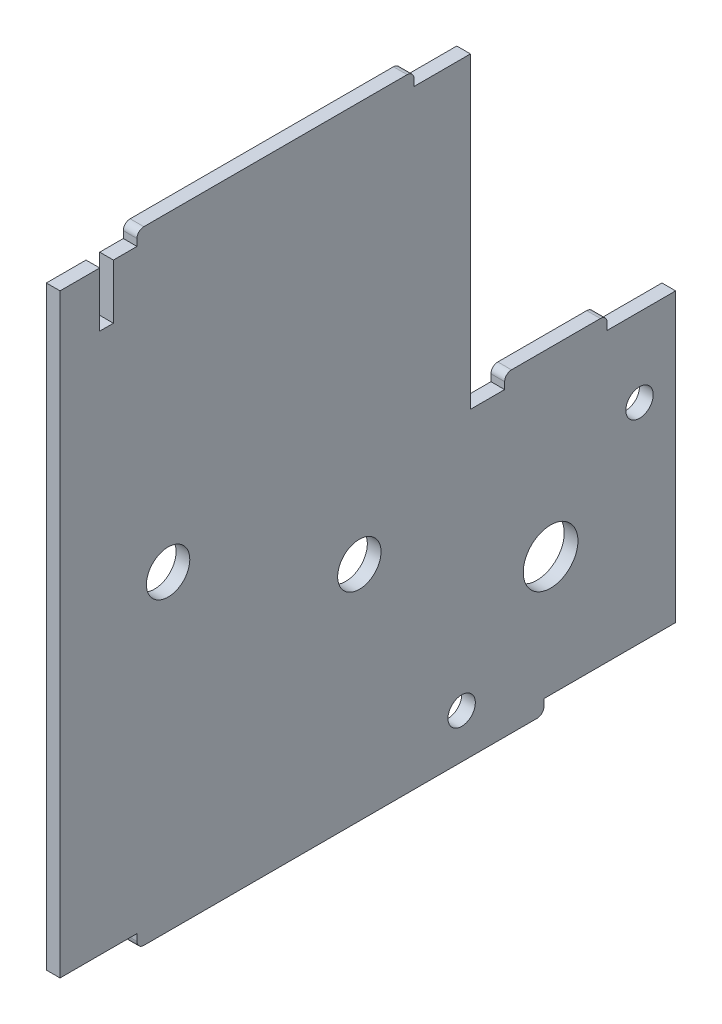
ISO-10303-21;
HEADER;
FILE_DESCRIPTION(('STEP AP214'),'2;1');
FILE_NAME('part.step','',(''),(''),'','','');
FILE_SCHEMA(('AUTOMOTIVE_DESIGN { 1 0 10303 214 1 1 1 1 }'));
ENDSEC;
DATA;
#1=APPLICATION_CONTEXT('core data for automotive mechanical design processes');
#2=APPLICATION_PROTOCOL_DEFINITION('international standard','automotive_design',2000,#1);
#3=PRODUCT_CONTEXT('',#1,'mechanical');
#4=PRODUCT('Part','Part','',(#3));
#5=PRODUCT_RELATED_PRODUCT_CATEGORY('part','',(#4));
#6=PRODUCT_DEFINITION_FORMATION('','',#4);
#7=PRODUCT_DEFINITION_CONTEXT('part definition',#1,'design');
#8=PRODUCT_DEFINITION('design','',#6,#7);
#9=PRODUCT_DEFINITION_SHAPE('','',#8);
#10=(LENGTH_UNIT() NAMED_UNIT(*) SI_UNIT(.MILLI.,.METRE.));
#11=(NAMED_UNIT(*) PLANE_ANGLE_UNIT() SI_UNIT($,.RADIAN.));
#12=(NAMED_UNIT(*) SI_UNIT($,.STERADIAN.) SOLID_ANGLE_UNIT());
#13=UNCERTAINTY_MEASURE_WITH_UNIT(LENGTH_MEASURE(1.E-05),#10,'distance_accuracy_value','');
#14=(GEOMETRIC_REPRESENTATION_CONTEXT(3) GLOBAL_UNCERTAINTY_ASSIGNED_CONTEXT((#13)) GLOBAL_UNIT_ASSIGNED_CONTEXT((#10,
#11,#12)) REPRESENTATION_CONTEXT('',''));
#15=CARTESIAN_POINT('',(0.,0.,0.));
#16=DIRECTION('',(0.,0.,1.));
#17=DIRECTION('',(1.,0.,0.));
#18=AXIS2_PLACEMENT_3D('',#15,#16,#17);
#19=CARTESIAN_POINT('',(2.,3.03009240885106,-30.5193675943872));
#20=DIRECTION('',(-1.,0.,0.));
#21=DIRECTION('',(0.,0.,1.));
#22=AXIS2_PLACEMENT_3D('',#19,#20,#21);
#23=PLANE('',#22);
#24=CARTESIAN_POINT('',(2.,3.53009240885117,19.6806324056115));
#25=DIRECTION('',(1.,0.,0.));
#26=DIRECTION('',(0.,0.,-1.));
#27=AXIS2_PLACEMENT_3D('',#24,#25,#26);
#28=CIRCLE('',#27,3.17);
#29=CARTESIAN_POINT('',(2.,3.53009240885117,16.5106324056115));
#30=VERTEX_POINT('',#29);
#31=EDGE_CURVE('E502',#30,#30,#28,.T.);
#32=ORIENTED_EDGE('',*,*,#31,.F.);
#33=EDGE_LOOP('',(#32));
#34=FACE_BOUND('',#33,.T.);
#35=CARTESIAN_POINT('',(2.,-35.4699075911488,-23.2338469677415));
#36=DIRECTION('',(1.,0.,0.));
#37=DIRECTION('',(0.,0.,-1.));
#38=AXIS2_PLACEMENT_3D('',#35,#36,#37);
#39=CIRCLE('',#38,2.);
#40=CARTESIAN_POINT('',(2.,-35.4699075911488,-25.2338469677415));
#41=VERTEX_POINT('',#40);
#42=EDGE_CURVE('E514',#41,#41,#39,.T.);
#43=ORIENTED_EDGE('',*,*,#42,.F.);
#44=EDGE_LOOP('',(#43));
#45=FACE_BOUND('',#44,.T.);
#46=DIRECTION('',(0.,0.,1.));
#47=VECTOR('',#46,1.);
#48=CARTESIAN_POINT('',(2.,47.0300924088512,-16.2688587230235));
#49=LINE('',#48,#47);
#50=CARTESIAN_POINT('',(2.,47.0300924088512,-24.5193675943872));
#51=VERTEX_POINT('',#50);
#52=CARTESIAN_POINT('',(2.,47.0300924088512,-16.2688587230235));
#53=VERTEX_POINT('',#52);
#54=EDGE_CURVE('E303',#51,#53,#49,.T.);
#55=ORIENTED_EDGE('',*,*,#54,.T.);
#56=DIRECTION('',(0.,1.,0.));
#57=VECTOR('',#56,1.);
#58=CARTESIAN_POINT('',(2.,47.0300924088512,-16.2688587230235));
#59=LINE('',#58,#57);
#60=CARTESIAN_POINT('',(2.,48.0300924088512,-16.2688587230235));
#61=VERTEX_POINT('',#60);
#62=EDGE_CURVE('E151',#53,#61,#59,.T.);
#63=ORIENTED_EDGE('',*,*,#62,.T.);
#64=CARTESIAN_POINT('',(2.,48.0300924088512,-15.2688587230235));
#65=DIRECTION('',(1.,0.,0.));
#66=DIRECTION('',(0.,0.,-1.));
#67=AXIS2_PLACEMENT_3D('',#64,#65,#66);
#68=CIRCLE('',#67,1.);
#69=CARTESIAN_POINT('',(2.,49.0300924088512,-15.2688587230235));
#70=VERTEX_POINT('',#69);
#71=EDGE_CURVE('E378',#61,#70,#68,.T.);
#72=ORIENTED_EDGE('',*,*,#71,.T.);
#73=DIRECTION('',(0.,0.,1.));
#74=VECTOR('',#73,1.);
#75=CARTESIAN_POINT('',(2.,49.0300924088512,-15.2688587230235));
#76=LINE('',#75,#74);
#77=CARTESIAN_POINT('',(2.,49.0300924088512,23.2301235342465));
#78=VERTEX_POINT('',#77);
#79=EDGE_CURVE('E397',#70,#78,#76,.T.);
#80=ORIENTED_EDGE('',*,*,#79,.T.);
#81=CARTESIAN_POINT('',(2.,48.0300924088512,23.2301235342465));
#82=DIRECTION('',(1.,0.,0.));
#83=DIRECTION('',(0.,0.,1.));
#84=AXIS2_PLACEMENT_3D('',#81,#82,#83);
#85=CIRCLE('',#84,1.);
#86=CARTESIAN_POINT('',(2.,48.0300924088512,24.2301235342465));
#87=VERTEX_POINT('',#86);
#88=EDGE_CURVE('E394',#78,#87,#85,.T.);
#89=ORIENTED_EDGE('',*,*,#88,.T.);
#90=DIRECTION('',(0.,-1.,0.));
#91=VECTOR('',#90,1.);
#92=CARTESIAN_POINT('',(2.,47.0300924088512,24.2301235342465));
#93=LINE('',#92,#91);
#94=CARTESIAN_POINT('',(2.,47.0300924088512,24.2301235342465));
#95=VERTEX_POINT('',#94);
#96=EDGE_CURVE('E396',#87,#95,#93,.T.);
#97=ORIENTED_EDGE('',*,*,#96,.T.);
#98=DIRECTION('',(0.,0.,1.));
#99=VECTOR('',#98,1.);
#100=CARTESIAN_POINT('',(2.,47.0300924088512,27.6806324056115));
#101=LINE('',#100,#99);
#102=CARTESIAN_POINT('',(2.,47.0300924088512,27.6806324056115));
#103=VERTEX_POINT('',#102);
#104=EDGE_CURVE('E399',#95,#103,#101,.T.);
#105=ORIENTED_EDGE('',*,*,#104,.T.);
#106=DIRECTION('',(0.,-1.,0.));
#107=VECTOR('',#106,1.);
#108=CARTESIAN_POINT('',(2.,39.0300924088512,27.6806324056115));
#109=LINE('',#108,#107);
#110=CARTESIAN_POINT('',(2.,39.0300924088512,27.6806324056115));
#111=VERTEX_POINT('',#110);
#112=EDGE_CURVE('E405',#103,#111,#109,.T.);
#113=ORIENTED_EDGE('',*,*,#112,.T.);
#114=DIRECTION('',(0.,0.,1.));
#115=VECTOR('',#114,1.);
#116=CARTESIAN_POINT('',(2.,39.0300924088512,27.6806324056115));
#117=LINE('',#116,#115);
#118=CARTESIAN_POINT('',(2.,39.0300924088512,29.6806324056115));
#119=VERTEX_POINT('',#118);
#120=EDGE_CURVE('E407',#111,#119,#117,.T.);
#121=ORIENTED_EDGE('',*,*,#120,.T.);
#122=DIRECTION('',(0.,1.,0.));
#123=VECTOR('',#122,1.);
#124=CARTESIAN_POINT('',(2.,39.0300924088512,29.6806324056115));
#125=LINE('',#124,#123);
#126=CARTESIAN_POINT('',(2.,47.0300924088512,29.6806324056115));
#127=VERTEX_POINT('',#126);
#128=EDGE_CURVE('E409',#119,#127,#125,.T.);
#129=ORIENTED_EDGE('',*,*,#128,.T.);
#130=DIRECTION('',(0.,0.,1.));
#131=VECTOR('',#130,1.);
#132=CARTESIAN_POINT('',(2.,47.0300924088512,29.6806324056115));
#133=LINE('',#132,#131);
#134=CARTESIAN_POINT('',(2.,47.0300924088512,35.4806324056113));
#135=VERTEX_POINT('',#134);
#136=EDGE_CURVE('E411',#127,#135,#133,.T.);
#137=ORIENTED_EDGE('',*,*,#136,.T.);
#138=DIRECTION('',(0.,-1.,0.));
#139=VECTOR('',#138,1.);
#140=CARTESIAN_POINT('',(2.,-39.9699075911489,35.4806324056113));
#141=LINE('',#140,#139);
#142=CARTESIAN_POINT('',(2.,-39.9699075911489,35.4806324056113));
#143=VERTEX_POINT('',#142);
#144=EDGE_CURVE('E413',#135,#143,#141,.T.);
#145=ORIENTED_EDGE('',*,*,#144,.T.);
#146=DIRECTION('',(0.,0.,-1.));
#147=VECTOR('',#146,1.);
#148=CARTESIAN_POINT('',(2.,-39.9699075911489,35.4806324056113));
#149=LINE('',#148,#147);
#150=CARTESIAN_POINT('',(2.,-39.9699075911489,24.2301235342488));
#151=VERTEX_POINT('',#150);
#152=EDGE_CURVE('E415',#143,#151,#149,.T.);
#153=ORIENTED_EDGE('',*,*,#152,.T.);
#154=DIRECTION('',(0.,-1.,0.));
#155=VECTOR('',#154,1.);
#156=CARTESIAN_POINT('',(2.,-39.9699075911489,24.2301235342488));
#157=LINE('',#156,#155);
#158=CARTESIAN_POINT('',(2.,-40.9699075911488,24.2301235342489));
#159=VERTEX_POINT('',#158);
#160=EDGE_CURVE('E417',#151,#159,#157,.T.);
#161=ORIENTED_EDGE('',*,*,#160,.T.);
#162=CARTESIAN_POINT('',(2.,-40.9699075911488,23.230123534249));
#163=DIRECTION('',(1.,0.,0.));
#164=DIRECTION('',(0.,0.,1.));
#165=AXIS2_PLACEMENT_3D('',#162,#163,#164);
#166=CIRCLE('',#165,0.999999999999914);
#167=CARTESIAN_POINT('',(2.,-41.9699075911489,23.2301235342488));
#168=VERTEX_POINT('',#167);
#169=EDGE_CURVE('E419',#159,#168,#166,.T.);
#170=ORIENTED_EDGE('',*,*,#169,.T.);
#171=DIRECTION('',(0.,0.,-1.));
#172=VECTOR('',#171,1.);
#173=CARTESIAN_POINT('',(2.,-41.9699075911489,23.2301235342488));
#174=LINE('',#173,#172);
#175=CARTESIAN_POINT('',(2.,-41.9699075911488,-34.2688587230223));
#176=VERTEX_POINT('',#175);
#177=EDGE_CURVE('E421',#168,#176,#174,.T.);
#178=ORIENTED_EDGE('',*,*,#177,.T.);
#179=CARTESIAN_POINT('',(2.,-40.9699075911488,-34.2688587230223));
#180=DIRECTION('',(1.,0.,0.));
#181=DIRECTION('',(0.,0.,-1.));
#182=AXIS2_PLACEMENT_3D('',#179,#180,#181);
#183=CIRCLE('',#182,0.999999999999966);
#184=CARTESIAN_POINT('',(2.,-40.9699075911488,-35.2688587230223));
#185=VERTEX_POINT('',#184);
#186=EDGE_CURVE('E423',#176,#185,#183,.T.);
#187=ORIENTED_EDGE('',*,*,#186,.T.);
#188=DIRECTION('',(0.,1.,0.));
#189=VECTOR('',#188,1.);
#190=CARTESIAN_POINT('',(2.,-39.9699075911489,-35.2688587230223));
#191=LINE('',#190,#189);
#192=CARTESIAN_POINT('',(2.,-39.9699075911489,-35.2688587230223));
#193=VERTEX_POINT('',#192);
#194=EDGE_CURVE('E425',#185,#193,#191,.T.);
#195=ORIENTED_EDGE('',*,*,#194,.T.);
#196=DIRECTION('',(0.,0.,-1.));
#197=VECTOR('',#196,1.);
#198=CARTESIAN_POINT('',(2.,-39.9699075911489,-54.5193675943872));
#199=LINE('',#198,#197);
#200=CARTESIAN_POINT('',(2.,-39.9699075911489,-54.5193675943872));
#201=VERTEX_POINT('',#200);
#202=EDGE_CURVE('E427',#193,#201,#199,.T.);
#203=ORIENTED_EDGE('',*,*,#202,.T.);
#204=DIRECTION('',(0.,1.,0.));
#205=VECTOR('',#204,1.);
#206=CARTESIAN_POINT('',(2.,-39.9699075911489,-54.5193675943872));
#207=LINE('',#206,#205);
#208=CARTESIAN_POINT('',(2.,2.03009240885107,-54.5193675943873));
#209=VERTEX_POINT('',#208);
#210=EDGE_CURVE('E429',#201,#209,#207,.T.);
#211=ORIENTED_EDGE('',*,*,#210,.T.);
#212=DIRECTION('',(0.,0.,1.));
#213=VECTOR('',#212,1.);
#214=CARTESIAN_POINT('',(2.,2.03009240885107,-54.5193675943873));
#215=LINE('',#214,#213);
#216=CARTESIAN_POINT('',(2.,2.03009240885108,-44.5193675943872));
#217=VERTEX_POINT('',#216);
#218=EDGE_CURVE('E431',#209,#217,#215,.T.);
#219=ORIENTED_EDGE('',*,*,#218,.T.);
#220=DIRECTION('',(0.,1.,0.));
#221=VECTOR('',#220,1.);
#222=CARTESIAN_POINT('',(2.,2.03009240885108,-44.5193675943872));
#223=LINE('',#222,#221);
#224=CARTESIAN_POINT('',(2.,3.03009240885107,-44.5193675943872));
#225=VERTEX_POINT('',#224);
#226=EDGE_CURVE('E433',#217,#225,#223,.T.);
#227=ORIENTED_EDGE('',*,*,#226,.T.);
#228=CARTESIAN_POINT('',(2.,3.03009240885108,-43.5193675943872));
#229=DIRECTION('',(1.,0.,0.));
#230=DIRECTION('',(0.,0.,-1.));
#231=AXIS2_PLACEMENT_3D('',#228,#229,#230);
#232=CIRCLE('',#231,1.);
#233=CARTESIAN_POINT('',(2.,4.03009240885108,-43.5193675943872));
#234=VERTEX_POINT('',#233);
#235=EDGE_CURVE('E435',#225,#234,#232,.T.);
#236=ORIENTED_EDGE('',*,*,#235,.T.);
#237=DIRECTION('',(0.,0.,1.));
#238=VECTOR('',#237,1.);
#239=CARTESIAN_POINT('',(2.,4.03009240885108,-43.5193675943872));
#240=LINE('',#239,#238);
#241=CARTESIAN_POINT('',(2.,4.03009240885106,-30.5193675943872));
#242=VERTEX_POINT('',#241);
#243=EDGE_CURVE('E437',#234,#242,#240,.T.);
#244=ORIENTED_EDGE('',*,*,#243,.T.);
#245=CARTESIAN_POINT('',(2.,3.03009240885106,-30.5193675943872));
#246=DIRECTION('',(1.,0.,0.));
#247=DIRECTION('',(0.,0.,1.));
#248=AXIS2_PLACEMENT_3D('',#245,#246,#247);
#249=CIRCLE('',#248,1.);
#250=CARTESIAN_POINT('',(2.,3.03009240885106,-29.5193675943872));
#251=VERTEX_POINT('',#250);
#252=EDGE_CURVE('E230',#242,#251,#249,.T.);
#253=ORIENTED_EDGE('',*,*,#252,.T.);
#254=DIRECTION('',(0.,-1.,0.));
#255=VECTOR('',#254,1.);
#256=CARTESIAN_POINT('',(2.,2.03009240885107,-29.5193675943872));
#257=LINE('',#256,#255);
#258=CARTESIAN_POINT('',(2.,2.03009240885107,-29.5193675943872));
#259=VERTEX_POINT('',#258);
#260=EDGE_CURVE('E224',#251,#259,#257,.T.);
#261=ORIENTED_EDGE('',*,*,#260,.T.);
#262=DIRECTION('',(0.,0.,1.));
#263=VECTOR('',#262,1.);
#264=CARTESIAN_POINT('',(2.,2.03009240885107,-29.5193675943872));
#265=LINE('',#264,#263);
#266=CARTESIAN_POINT('',(2.,2.03009240885107,-24.5193675943872));
#267=VERTEX_POINT('',#266);
#268=EDGE_CURVE('E228',#259,#267,#265,.T.);
#269=ORIENTED_EDGE('',*,*,#268,.T.);
#270=DIRECTION('',(0.,1.,0.));
#271=VECTOR('',#270,1.);
#272=CARTESIAN_POINT('',(2.,2.03009240885107,-24.5193675943872));
#273=LINE('',#272,#271);
#274=EDGE_CURVE('E48',#267,#51,#273,.T.);
#275=ORIENTED_EDGE('',*,*,#274,.T.);
#276=EDGE_LOOP('',(#55,#63,#72,#80,#89,#97,#105,#113,#121,#129,#137,#145,#153,#161,#170,#178,
#187,#195,#203,#211,#219,#227,#236,#244,#253,#261,#269,#275));
#277=FACE_BOUND('',#276,.T.);
#278=CARTESIAN_POINT('',(2.,-9.46990759114884,-49.2338469677415));
#279=DIRECTION('',(1.,0.,0.));
#280=DIRECTION('',(0.,0.,-1.));
#281=AXIS2_PLACEMENT_3D('',#278,#279,#280);
#282=CIRCLE('',#281,2.);
#283=CARTESIAN_POINT('',(2.,-9.46990759114884,-51.2338469677415));
#284=VERTEX_POINT('',#283);
#285=EDGE_CURVE('E252',#284,#284,#282,.T.);
#286=ORIENTED_EDGE('',*,*,#285,.F.);
#287=EDGE_LOOP('',(#286));
#288=FACE_BOUND('',#287,.T.);
#289=CARTESIAN_POINT('',(2.,-22.4699075911488,-36.2338469677415));
#290=DIRECTION('',(1.,0.,0.));
#291=DIRECTION('',(0.,0.,-1.));
#292=AXIS2_PLACEMENT_3D('',#289,#290,#291);
#293=CIRCLE('',#292,4.00000000000001);
#294=CARTESIAN_POINT('',(2.,-22.4699075911488,-40.2338469677415));
#295=VERTEX_POINT('',#294);
#296=EDGE_CURVE('E508',#295,#295,#293,.T.);
#297=ORIENTED_EDGE('',*,*,#296,.F.);
#298=EDGE_LOOP('',(#297));
#299=FACE_BOUND('',#298,.T.);
#300=CARTESIAN_POINT('',(2.,-9.46990759114883,-8.27660728106503));
#301=DIRECTION('',(1.,0.,0.));
#302=DIRECTION('',(0.,0.,-1.));
#303=AXIS2_PLACEMENT_3D('',#300,#301,#302);
#304=CIRCLE('',#303,3.17);
#305=CARTESIAN_POINT('',(2.,-9.46990759114883,-11.446607281065));
#306=VERTEX_POINT('',#305);
#307=EDGE_CURVE('E493',#306,#306,#304,.T.);
#308=ORIENTED_EDGE('',*,*,#307,.F.);
#309=EDGE_LOOP('',(#308));
#310=FACE_BOUND('',#309,.T.);
#311=ADVANCED_FACE('F31',(#34,#45,#277,#288,#299,#310),#23,.F.);
#312=CARTESIAN_POINT('',(0.,3.03009240885106,-30.5193675943872));
#313=DIRECTION('',(-1.,0.,0.));
#314=DIRECTION('',(0.,0.,1.));
#315=AXIS2_PLACEMENT_3D('',#312,#313,#314);
#316=PLANE('',#315);
#317=CARTESIAN_POINT('',(0.,3.53009240885117,19.6806324056115));
#318=DIRECTION('',(1.,0.,0.));
#319=DIRECTION('',(0.,0.,-1.));
#320=AXIS2_PLACEMENT_3D('',#317,#318,#319);
#321=CIRCLE('',#320,3.17);
#322=CARTESIAN_POINT('',(0.,3.53009240885117,16.5106324056115));
#323=VERTEX_POINT('',#322);
#324=EDGE_CURVE('E499',#323,#323,#321,.T.);
#325=ORIENTED_EDGE('',*,*,#324,.T.);
#326=EDGE_LOOP('',(#325));
#327=FACE_BOUND('',#326,.T.);
#328=CARTESIAN_POINT('',(0.,-35.4699075911488,-23.2338469677415));
#329=DIRECTION('',(1.,0.,0.));
#330=DIRECTION('',(0.,0.,-1.));
#331=AXIS2_PLACEMENT_3D('',#328,#329,#330);
#332=CIRCLE('',#331,2.);
#333=CARTESIAN_POINT('',(0.,-35.4699075911488,-25.2338469677415));
#334=VERTEX_POINT('',#333);
#335=EDGE_CURVE('E511',#334,#334,#332,.T.);
#336=ORIENTED_EDGE('',*,*,#335,.T.);
#337=EDGE_LOOP('',(#336));
#338=FACE_BOUND('',#337,.T.);
#339=DIRECTION('',(0.,0.,1.));
#340=VECTOR('',#339,1.);
#341=CARTESIAN_POINT('',(0.,47.0300924088512,-16.2688587230235));
#342=LINE('',#341,#340);
#343=CARTESIAN_POINT('',(0.,47.0300924088512,-24.5193675943872));
#344=VERTEX_POINT('',#343);
#345=CARTESIAN_POINT('',(0.,47.0300924088512,-16.2688587230235));
#346=VERTEX_POINT('',#345);
#347=EDGE_CURVE('E248',#344,#346,#342,.T.);
#348=ORIENTED_EDGE('',*,*,#347,.F.);
#349=DIRECTION('',(0.,1.,0.));
#350=VECTOR('',#349,1.);
#351=CARTESIAN_POINT('',(0.,2.03009240885107,-24.5193675943872));
#352=LINE('',#351,#350);
#353=CARTESIAN_POINT('',(0.,2.03009240885107,-24.5193675943872));
#354=VERTEX_POINT('',#353);
#355=EDGE_CURVE('E143',#354,#344,#352,.T.);
#356=ORIENTED_EDGE('',*,*,#355,.F.);
#357=DIRECTION('',(0.,0.,1.));
#358=VECTOR('',#357,1.);
#359=CARTESIAN_POINT('',(0.,2.03009240885107,-29.5193675943872));
#360=LINE('',#359,#358);
#361=CARTESIAN_POINT('',(0.,2.03009240885107,-29.5193675943872));
#362=VERTEX_POINT('',#361);
#363=EDGE_CURVE('E137',#362,#354,#360,.T.);
#364=ORIENTED_EDGE('',*,*,#363,.F.);
#365=DIRECTION('',(0.,-1.,0.));
#366=VECTOR('',#365,1.);
#367=CARTESIAN_POINT('',(0.,2.03009240885107,-29.5193675943872));
#368=LINE('',#367,#366);
#369=CARTESIAN_POINT('',(0.,3.03009240885106,-29.5193675943872));
#370=VERTEX_POINT('',#369);
#371=EDGE_CURVE('E238',#370,#362,#368,.T.);
#372=ORIENTED_EDGE('',*,*,#371,.F.);
#373=CARTESIAN_POINT('',(0.,3.03009240885106,-30.5193675943872));
#374=DIRECTION('',(1.,0.,0.));
#375=DIRECTION('',(0.,0.,1.));
#376=AXIS2_PLACEMENT_3D('',#373,#374,#375);
#377=CIRCLE('',#376,1.);
#378=CARTESIAN_POINT('',(0.,4.03009240885106,-30.5193675943872));
#379=VERTEX_POINT('',#378);
#380=EDGE_CURVE('E298',#379,#370,#377,.T.);
#381=ORIENTED_EDGE('',*,*,#380,.F.);
#382=DIRECTION('',(0.,0.,1.));
#383=VECTOR('',#382,1.);
#384=CARTESIAN_POINT('',(0.,4.03009240885108,-43.5193675943872));
#385=LINE('',#384,#383);
#386=CARTESIAN_POINT('',(0.,4.03009240885108,-43.5193675943872));
#387=VERTEX_POINT('',#386);
#388=EDGE_CURVE('E296',#387,#379,#385,.T.);
#389=ORIENTED_EDGE('',*,*,#388,.F.);
#390=CARTESIAN_POINT('',(0.,3.03009240885108,-43.5193675943872));
#391=DIRECTION('',(1.,0.,0.));
#392=DIRECTION('',(0.,0.,-1.));
#393=AXIS2_PLACEMENT_3D('',#390,#391,#392);
#394=CIRCLE('',#393,1.);
#395=CARTESIAN_POINT('',(0.,3.03009240885107,-44.5193675943872));
#396=VERTEX_POINT('',#395);
#397=EDGE_CURVE('E294',#396,#387,#394,.T.);
#398=ORIENTED_EDGE('',*,*,#397,.F.);
#399=DIRECTION('',(0.,1.,0.));
#400=VECTOR('',#399,1.);
#401=CARTESIAN_POINT('',(0.,2.03009240885108,-44.5193675943872));
#402=LINE('',#401,#400);
#403=CARTESIAN_POINT('',(0.,2.03009240885108,-44.5193675943872));
#404=VERTEX_POINT('',#403);
#405=EDGE_CURVE('E292',#404,#396,#402,.T.);
#406=ORIENTED_EDGE('',*,*,#405,.F.);
#407=DIRECTION('',(0.,0.,1.));
#408=VECTOR('',#407,1.);
#409=CARTESIAN_POINT('',(0.,2.03009240885107,-54.5193675943873));
#410=LINE('',#409,#408);
#411=CARTESIAN_POINT('',(0.,2.03009240885107,-54.5193675943873));
#412=VERTEX_POINT('',#411);
#413=EDGE_CURVE('E290',#412,#404,#410,.T.);
#414=ORIENTED_EDGE('',*,*,#413,.F.);
#415=DIRECTION('',(0.,1.,0.));
#416=VECTOR('',#415,1.);
#417=CARTESIAN_POINT('',(0.,-39.9699075911489,-54.5193675943872));
#418=LINE('',#417,#416);
#419=CARTESIAN_POINT('',(0.,-39.9699075911489,-54.5193675943872));
#420=VERTEX_POINT('',#419);
#421=EDGE_CURVE('E288',#420,#412,#418,.T.);
#422=ORIENTED_EDGE('',*,*,#421,.F.);
#423=DIRECTION('',(0.,0.,-1.));
#424=VECTOR('',#423,1.);
#425=CARTESIAN_POINT('',(0.,-39.9699075911489,-54.5193675943872));
#426=LINE('',#425,#424);
#427=CARTESIAN_POINT('',(0.,-39.9699075911489,-35.2688587230223));
#428=VERTEX_POINT('',#427);
#429=EDGE_CURVE('E286',#428,#420,#426,.T.);
#430=ORIENTED_EDGE('',*,*,#429,.F.);
#431=DIRECTION('',(0.,1.,0.));
#432=VECTOR('',#431,1.);
#433=CARTESIAN_POINT('',(0.,-39.9699075911489,-35.2688587230223));
#434=LINE('',#433,#432);
#435=CARTESIAN_POINT('',(0.,-40.9699075911488,-35.2688587230223));
#436=VERTEX_POINT('',#435);
#437=EDGE_CURVE('E284',#436,#428,#434,.T.);
#438=ORIENTED_EDGE('',*,*,#437,.F.);
#439=CARTESIAN_POINT('',(0.,-40.9699075911488,-34.2688587230223));
#440=DIRECTION('',(1.,0.,0.));
#441=DIRECTION('',(0.,0.,-1.));
#442=AXIS2_PLACEMENT_3D('',#439,#440,#441);
#443=CIRCLE('',#442,0.999999999999966);
#444=CARTESIAN_POINT('',(0.,-41.9699075911488,-34.2688587230223));
#445=VERTEX_POINT('',#444);
#446=EDGE_CURVE('E282',#445,#436,#443,.T.);
#447=ORIENTED_EDGE('',*,*,#446,.F.);
#448=DIRECTION('',(0.,0.,-1.));
#449=VECTOR('',#448,1.);
#450=CARTESIAN_POINT('',(0.,-41.9699075911489,23.2301235342488));
#451=LINE('',#450,#449);
#452=CARTESIAN_POINT('',(0.,-41.9699075911489,23.2301235342488));
#453=VERTEX_POINT('',#452);
#454=EDGE_CURVE('E280',#453,#445,#451,.T.);
#455=ORIENTED_EDGE('',*,*,#454,.F.);
#456=CARTESIAN_POINT('',(0.,-40.9699075911488,23.230123534249));
#457=DIRECTION('',(1.,0.,0.));
#458=DIRECTION('',(0.,0.,1.));
#459=AXIS2_PLACEMENT_3D('',#456,#457,#458);
#460=CIRCLE('',#459,0.999999999999914);
#461=CARTESIAN_POINT('',(0.,-40.9699075911488,24.2301235342489));
#462=VERTEX_POINT('',#461);
#463=EDGE_CURVE('E278',#462,#453,#460,.T.);
#464=ORIENTED_EDGE('',*,*,#463,.F.);
#465=DIRECTION('',(0.,-1.,0.));
#466=VECTOR('',#465,1.);
#467=CARTESIAN_POINT('',(0.,-39.9699075911489,24.2301235342488));
#468=LINE('',#467,#466);
#469=CARTESIAN_POINT('',(0.,-39.9699075911489,24.2301235342488));
#470=VERTEX_POINT('',#469);
#471=EDGE_CURVE('E276',#470,#462,#468,.T.);
#472=ORIENTED_EDGE('',*,*,#471,.F.);
#473=DIRECTION('',(0.,0.,-1.));
#474=VECTOR('',#473,1.);
#475=CARTESIAN_POINT('',(0.,-39.9699075911489,35.4806324056113));
#476=LINE('',#475,#474);
#477=CARTESIAN_POINT('',(0.,-39.9699075911489,35.4806324056113));
#478=VERTEX_POINT('',#477);
#479=EDGE_CURVE('E274',#478,#470,#476,.T.);
#480=ORIENTED_EDGE('',*,*,#479,.F.);
#481=DIRECTION('',(0.,-1.,0.));
#482=VECTOR('',#481,1.);
#483=CARTESIAN_POINT('',(0.,-39.9699075911489,35.4806324056113));
#484=LINE('',#483,#482);
#485=CARTESIAN_POINT('',(0.,47.0300924088512,35.4806324056113));
#486=VERTEX_POINT('',#485);
#487=EDGE_CURVE('E272',#486,#478,#484,.T.);
#488=ORIENTED_EDGE('',*,*,#487,.F.);
#489=DIRECTION('',(0.,0.,1.));
#490=VECTOR('',#489,1.);
#491=CARTESIAN_POINT('',(0.,47.0300924088512,29.6806324056115));
#492=LINE('',#491,#490);
#493=CARTESIAN_POINT('',(0.,47.0300924088512,29.6806324056115));
#494=VERTEX_POINT('',#493);
#495=EDGE_CURVE('E270',#494,#486,#492,.T.);
#496=ORIENTED_EDGE('',*,*,#495,.F.);
#497=DIRECTION('',(0.,1.,0.));
#498=VECTOR('',#497,1.);
#499=CARTESIAN_POINT('',(0.,39.0300924088512,29.6806324056115));
#500=LINE('',#499,#498);
#501=CARTESIAN_POINT('',(0.,39.0300924088512,29.6806324056115));
#502=VERTEX_POINT('',#501);
#503=EDGE_CURVE('E268',#502,#494,#500,.T.);
#504=ORIENTED_EDGE('',*,*,#503,.F.);
#505=DIRECTION('',(0.,0.,1.));
#506=VECTOR('',#505,1.);
#507=CARTESIAN_POINT('',(0.,39.0300924088512,27.6806324056115));
#508=LINE('',#507,#506);
#509=CARTESIAN_POINT('',(0.,39.0300924088512,27.6806324056115));
#510=VERTEX_POINT('',#509);
#511=EDGE_CURVE('E266',#510,#502,#508,.T.);
#512=ORIENTED_EDGE('',*,*,#511,.F.);
#513=DIRECTION('',(0.,-1.,0.));
#514=VECTOR('',#513,1.);
#515=CARTESIAN_POINT('',(0.,39.0300924088512,27.6806324056115));
#516=LINE('',#515,#514);
#517=CARTESIAN_POINT('',(0.,47.0300924088512,27.6806324056115));
#518=VERTEX_POINT('',#517);
#519=EDGE_CURVE('E264',#518,#510,#516,.T.);
#520=ORIENTED_EDGE('',*,*,#519,.F.);
#521=DIRECTION('',(0.,0.,1.));
#522=VECTOR('',#521,1.);
#523=CARTESIAN_POINT('',(0.,47.0300924088512,27.6806324056115));
#524=LINE('',#523,#522);
#525=CARTESIAN_POINT('',(0.,47.0300924088512,24.2301235342465));
#526=VERTEX_POINT('',#525);
#527=EDGE_CURVE('E262',#526,#518,#524,.T.);
#528=ORIENTED_EDGE('',*,*,#527,.F.);
#529=DIRECTION('',(0.,-1.,0.));
#530=VECTOR('',#529,1.);
#531=CARTESIAN_POINT('',(0.,47.0300924088512,24.2301235342465));
#532=LINE('',#531,#530);
#533=CARTESIAN_POINT('',(0.,48.0300924088512,24.2301235342465));
#534=VERTEX_POINT('',#533);
#535=EDGE_CURVE('E260',#534,#526,#532,.T.);
#536=ORIENTED_EDGE('',*,*,#535,.F.);
#537=CARTESIAN_POINT('',(0.,48.0300924088512,23.2301235342465));
#538=DIRECTION('',(1.,0.,0.));
#539=DIRECTION('',(0.,0.,1.));
#540=AXIS2_PLACEMENT_3D('',#537,#538,#539);
#541=CIRCLE('',#540,1.);
#542=CARTESIAN_POINT('',(0.,49.0300924088512,23.2301235342465));
#543=VERTEX_POINT('',#542);
#544=EDGE_CURVE('E258',#543,#534,#541,.T.);
#545=ORIENTED_EDGE('',*,*,#544,.F.);
#546=DIRECTION('',(0.,0.,1.));
#547=VECTOR('',#546,1.);
#548=CARTESIAN_POINT('',(0.,49.0300924088512,-15.2688587230235));
#549=LINE('',#548,#547);
#550=CARTESIAN_POINT('',(0.,49.0300924088512,-15.2688587230235));
#551=VERTEX_POINT('',#550);
#552=EDGE_CURVE('E256',#551,#543,#549,.T.);
#553=ORIENTED_EDGE('',*,*,#552,.F.);
#554=CARTESIAN_POINT('',(0.,48.0300924088512,-15.2688587230235));
#555=DIRECTION('',(1.,0.,0.));
#556=DIRECTION('',(0.,0.,-1.));
#557=AXIS2_PLACEMENT_3D('',#554,#555,#556);
#558=CIRCLE('',#557,1.);
#559=CARTESIAN_POINT('',(0.,48.0300924088512,-16.2688587230235));
#560=VERTEX_POINT('',#559);
#561=EDGE_CURVE('E254',#560,#551,#558,.T.);
#562=ORIENTED_EDGE('',*,*,#561,.F.);
#563=DIRECTION('',(0.,1.,0.));
#564=VECTOR('',#563,1.);
#565=CARTESIAN_POINT('',(0.,47.0300924088512,-16.2688587230235));
#566=LINE('',#565,#564);
#567=EDGE_CURVE('E251',#346,#560,#566,.T.);
#568=ORIENTED_EDGE('',*,*,#567,.F.);
#569=EDGE_LOOP('',(#348,#356,#364,#372,#381,#389,#398,#406,#414,#422,#430,#438,#447,#455,#464,
#472,#480,#488,#496,#504,#512,#520,#528,#536,#545,#553,#562,#568));
#570=FACE_BOUND('',#569,.T.);
#571=CARTESIAN_POINT('',(0.,-9.46990759114884,-49.2338469677415));
#572=DIRECTION('',(1.,0.,0.));
#573=DIRECTION('',(0.,0.,-1.));
#574=AXIS2_PLACEMENT_3D('',#571,#572,#573);
#575=CIRCLE('',#574,2.);
#576=CARTESIAN_POINT('',(0.,-9.46990759114884,-51.2338469677415));
#577=VERTEX_POINT('',#576);
#578=EDGE_CURVE('E517',#577,#577,#575,.T.);
#579=ORIENTED_EDGE('',*,*,#578,.T.);
#580=EDGE_LOOP('',(#579));
#581=FACE_BOUND('',#580,.T.);
#582=CARTESIAN_POINT('',(0.,-22.4699075911488,-36.2338469677415));
#583=DIRECTION('',(1.,0.,0.));
#584=DIRECTION('',(0.,0.,-1.));
#585=AXIS2_PLACEMENT_3D('',#582,#583,#584);
#586=CIRCLE('',#585,4.00000000000001);
#587=CARTESIAN_POINT('',(0.,-22.4699075911488,-40.2338469677415));
#588=VERTEX_POINT('',#587);
#589=EDGE_CURVE('E505',#588,#588,#586,.T.);
#590=ORIENTED_EDGE('',*,*,#589,.T.);
#591=EDGE_LOOP('',(#590));
#592=FACE_BOUND('',#591,.T.);
#593=CARTESIAN_POINT('',(0.,-9.46990759114883,-8.27660728106503));
#594=DIRECTION('',(1.,0.,0.));
#595=DIRECTION('',(0.,0.,-1.));
#596=AXIS2_PLACEMENT_3D('',#593,#594,#595);
#597=CIRCLE('',#596,3.17);
#598=CARTESIAN_POINT('',(0.,-9.46990759114883,-11.446607281065));
#599=VERTEX_POINT('',#598);
#600=EDGE_CURVE('E496',#599,#599,#597,.T.);
#601=ORIENTED_EDGE('',*,*,#600,.T.);
#602=EDGE_LOOP('',(#601));
#603=FACE_BOUND('',#602,.T.);
#604=ADVANCED_FACE('F382',(#327,#338,#570,#581,#592,#603),#316,.T.);
#605=CARTESIAN_POINT('',(2.,47.0300924088512,-16.2688587230235));
#606=DIRECTION('',(0.,-1.,0.));
#607=DIRECTION('',(0.,0.,-1.));
#608=AXIS2_PLACEMENT_3D('',#605,#606,#607);
#609=PLANE('',#608);
#610=ORIENTED_EDGE('',*,*,#347,.T.);
#611=DIRECTION('',(-1.,0.,0.));
#612=VECTOR('',#611,1.);
#613=CARTESIAN_POINT('',(2.,47.0300924088512,-16.2688587230235));
#614=LINE('',#613,#612);
#615=EDGE_CURVE('E11',#53,#346,#614,.T.);
#616=ORIENTED_EDGE('',*,*,#615,.F.);
#617=ORIENTED_EDGE('',*,*,#54,.F.);
#618=DIRECTION('',(-1.,0.,0.));
#619=VECTOR('',#618,1.);
#620=CARTESIAN_POINT('',(2.,47.0300924088512,-24.5193675943872));
#621=LINE('',#620,#619);
#622=EDGE_CURVE('E244',#51,#344,#621,.T.);
#623=ORIENTED_EDGE('',*,*,#622,.T.);
#624=EDGE_LOOP('',(#610,#616,#617,#623));
#625=FACE_BOUND('',#624,.T.);
#626=ADVANCED_FACE('F33',(#625),#609,.F.);
#627=CARTESIAN_POINT('',(2.,47.0300924088512,-16.2688587230235));
#628=DIRECTION('',(0.,0.,1.));
#629=DIRECTION('',(1.,0.,0.));
#630=AXIS2_PLACEMENT_3D('',#627,#628,#629);
#631=PLANE('',#630);
#632=ORIENTED_EDGE('',*,*,#567,.T.);
#633=DIRECTION('',(-1.,0.,0.));
#634=VECTOR('',#633,1.);
#635=CARTESIAN_POINT('',(2.,48.0300924088512,-16.2688587230235));
#636=LINE('',#635,#634);
#637=EDGE_CURVE('E40',#61,#560,#636,.T.);
#638=ORIENTED_EDGE('',*,*,#637,.F.);
#639=ORIENTED_EDGE('',*,*,#62,.F.);
#640=ORIENTED_EDGE('',*,*,#615,.T.);
#641=EDGE_LOOP('',(#632,#638,#639,#640));
#642=FACE_BOUND('',#641,.T.);
#643=ADVANCED_FACE('F795',(#642),#631,.F.);
#644=CARTESIAN_POINT('',(2.,48.0300924088512,-15.2688587230235));
#645=DIRECTION('',(-1.,0.,0.));
#646=DIRECTION('',(0.,0.,1.));
#647=AXIS2_PLACEMENT_3D('',#644,#645,#646);
#648=CYLINDRICAL_SURFACE('',#647,1.);
#649=ORIENTED_EDGE('',*,*,#561,.T.);
#650=DIRECTION('',(-1.,0.,0.));
#651=VECTOR('',#650,1.);
#652=CARTESIAN_POINT('',(2.,49.0300924088512,-15.2688587230235));
#653=LINE('',#652,#651);
#654=EDGE_CURVE('E370',#70,#551,#653,.T.);
#655=ORIENTED_EDGE('',*,*,#654,.F.);
#656=ORIENTED_EDGE('',*,*,#71,.F.);
#657=ORIENTED_EDGE('',*,*,#637,.T.);
#658=EDGE_LOOP('',(#649,#655,#656,#657));
#659=FACE_BOUND('',#658,.T.);
#660=ADVANCED_FACE('F376',(#659),#648,.T.);
#661=CARTESIAN_POINT('',(2.,49.0300924088512,-15.2688587230235));
#662=DIRECTION('',(0.,-1.,0.));
#663=DIRECTION('',(0.,0.,-1.));
#664=AXIS2_PLACEMENT_3D('',#661,#662,#663);
#665=PLANE('',#664);
#666=ORIENTED_EDGE('',*,*,#552,.T.);
#667=DIRECTION('',(-1.,0.,0.));
#668=VECTOR('',#667,1.);
#669=CARTESIAN_POINT('',(2.,49.0300924088512,23.2301235342465));
#670=LINE('',#669,#668);
#671=EDGE_CURVE('E367',#78,#543,#670,.T.);
#672=ORIENTED_EDGE('',*,*,#671,.F.);
#673=ORIENTED_EDGE('',*,*,#79,.F.);
#674=ORIENTED_EDGE('',*,*,#654,.T.);
#675=EDGE_LOOP('',(#666,#672,#673,#674));
#676=FACE_BOUND('',#675,.T.);
#677=ADVANCED_FACE('F388',(#676),#665,.F.);
#678=CARTESIAN_POINT('',(2.,48.0300924088512,23.2301235342465));
#679=DIRECTION('',(-1.,0.,0.));
#680=DIRECTION('',(0.,0.,1.));
#681=AXIS2_PLACEMENT_3D('',#678,#679,#680);
#682=CYLINDRICAL_SURFACE('',#681,1.);
#683=ORIENTED_EDGE('',*,*,#544,.T.);
#684=DIRECTION('',(-1.,0.,0.));
#685=VECTOR('',#684,1.);
#686=CARTESIAN_POINT('',(2.,48.0300924088512,24.2301235342465));
#687=LINE('',#686,#685);
#688=EDGE_CURVE('E364',#87,#534,#687,.T.);
#689=ORIENTED_EDGE('',*,*,#688,.F.);
#690=ORIENTED_EDGE('',*,*,#88,.F.);
#691=ORIENTED_EDGE('',*,*,#671,.T.);
#692=EDGE_LOOP('',(#683,#689,#690,#691));
#693=FACE_BOUND('',#692,.T.);
#694=ADVANCED_FACE('F392',(#693),#682,.T.);
#695=CARTESIAN_POINT('',(2.,47.0300924088512,24.2301235342465));
#696=DIRECTION('',(0.,0.,-1.));
#697=DIRECTION('',(-1.,0.,0.));
#698=AXIS2_PLACEMENT_3D('',#695,#696,#697);
#699=PLANE('',#698);
#700=ORIENTED_EDGE('',*,*,#535,.T.);
#701=DIRECTION('',(-1.,0.,0.));
#702=VECTOR('',#701,1.);
#703=CARTESIAN_POINT('',(2.,47.0300924088512,24.2301235342465));
#704=LINE('',#703,#702);
#705=EDGE_CURVE('E361',#95,#526,#704,.T.);
#706=ORIENTED_EDGE('',*,*,#705,.F.);
#707=ORIENTED_EDGE('',*,*,#96,.F.);
#708=ORIENTED_EDGE('',*,*,#688,.T.);
#709=EDGE_LOOP('',(#700,#706,#707,#708));
#710=FACE_BOUND('',#709,.T.);
#711=ADVANCED_FACE('F760',(#710),#699,.F.);
#712=CARTESIAN_POINT('',(2.,47.0300924088512,27.6806324056115));
#713=DIRECTION('',(0.,-1.,0.));
#714=DIRECTION('',(0.,0.,-1.));
#715=AXIS2_PLACEMENT_3D('',#712,#713,#714);
#716=PLANE('',#715);
#717=ORIENTED_EDGE('',*,*,#527,.T.);
#718=DIRECTION('',(-1.,0.,0.));
#719=VECTOR('',#718,1.);
#720=CARTESIAN_POINT('',(2.,47.0300924088512,27.6806324056115));
#721=LINE('',#720,#719);
#722=EDGE_CURVE('E358',#103,#518,#721,.T.);
#723=ORIENTED_EDGE('',*,*,#722,.F.);
#724=ORIENTED_EDGE('',*,*,#104,.F.);
#725=ORIENTED_EDGE('',*,*,#705,.T.);
#726=EDGE_LOOP('',(#717,#723,#724,#725));
#727=FACE_BOUND('',#726,.T.);
#728=ADVANCED_FACE('F750',(#727),#716,.F.);
#729=CARTESIAN_POINT('',(2.,39.0300924088512,27.6806324056115));
#730=DIRECTION('',(0.,0.,-1.));
#731=DIRECTION('',(-1.,0.,0.));
#732=AXIS2_PLACEMENT_3D('',#729,#730,#731);
#733=PLANE('',#732);
#734=ORIENTED_EDGE('',*,*,#519,.T.);
#735=DIRECTION('',(-1.,0.,0.));
#736=VECTOR('',#735,1.);
#737=CARTESIAN_POINT('',(2.,39.0300924088512,27.6806324056115));
#738=LINE('',#737,#736);
#739=EDGE_CURVE('E355',#111,#510,#738,.T.);
#740=ORIENTED_EDGE('',*,*,#739,.F.);
#741=ORIENTED_EDGE('',*,*,#112,.F.);
#742=ORIENTED_EDGE('',*,*,#722,.T.);
#743=EDGE_LOOP('',(#734,#740,#741,#742));
#744=FACE_BOUND('',#743,.T.);
#745=ADVANCED_FACE('F740',(#744),#733,.F.);
#746=CARTESIAN_POINT('',(2.,39.0300924088512,27.6806324056115));
#747=DIRECTION('',(0.,-1.,0.));
#748=DIRECTION('',(0.,0.,-1.));
#749=AXIS2_PLACEMENT_3D('',#746,#747,#748);
#750=PLANE('',#749);
#751=ORIENTED_EDGE('',*,*,#511,.T.);
#752=DIRECTION('',(-1.,0.,0.));
#753=VECTOR('',#752,1.);
#754=CARTESIAN_POINT('',(2.,39.0300924088512,29.6806324056115));
#755=LINE('',#754,#753);
#756=EDGE_CURVE('E352',#119,#502,#755,.T.);
#757=ORIENTED_EDGE('',*,*,#756,.F.);
#758=ORIENTED_EDGE('',*,*,#120,.F.);
#759=ORIENTED_EDGE('',*,*,#739,.T.);
#760=EDGE_LOOP('',(#751,#757,#758,#759));
#761=FACE_BOUND('',#760,.T.);
#762=ADVANCED_FACE('F730',(#761),#750,.F.);
#763=CARTESIAN_POINT('',(2.,39.0300924088512,29.6806324056115));
#764=DIRECTION('',(0.,0.,1.));
#765=DIRECTION('',(1.,0.,0.));
#766=AXIS2_PLACEMENT_3D('',#763,#764,#765);
#767=PLANE('',#766);
#768=ORIENTED_EDGE('',*,*,#503,.T.);
#769=DIRECTION('',(-1.,0.,0.));
#770=VECTOR('',#769,1.);
#771=CARTESIAN_POINT('',(2.,47.0300924088512,29.6806324056115));
#772=LINE('',#771,#770);
#773=EDGE_CURVE('E349',#127,#494,#772,.T.);
#774=ORIENTED_EDGE('',*,*,#773,.F.);
#775=ORIENTED_EDGE('',*,*,#128,.F.);
#776=ORIENTED_EDGE('',*,*,#756,.T.);
#777=EDGE_LOOP('',(#768,#774,#775,#776));
#778=FACE_BOUND('',#777,.T.);
#779=ADVANCED_FACE('F720',(#778),#767,.F.);
#780=CARTESIAN_POINT('',(2.,47.0300924088512,29.6806324056115));
#781=DIRECTION('',(0.,-1.,0.));
#782=DIRECTION('',(0.,0.,-1.));
#783=AXIS2_PLACEMENT_3D('',#780,#781,#782);
#784=PLANE('',#783);
#785=ORIENTED_EDGE('',*,*,#495,.T.);
#786=DIRECTION('',(-1.,0.,0.));
#787=VECTOR('',#786,1.);
#788=CARTESIAN_POINT('',(2.,47.0300924088512,35.4806324056113));
#789=LINE('',#788,#787);
#790=EDGE_CURVE('E346',#135,#486,#789,.T.);
#791=ORIENTED_EDGE('',*,*,#790,.F.);
#792=ORIENTED_EDGE('',*,*,#136,.F.);
#793=ORIENTED_EDGE('',*,*,#773,.T.);
#794=EDGE_LOOP('',(#785,#791,#792,#793));
#795=FACE_BOUND('',#794,.T.);
#796=ADVANCED_FACE('F710',(#795),#784,.F.);
#797=CARTESIAN_POINT('',(2.,-39.9699075911489,35.4806324056113));
#798=DIRECTION('',(0.,0.,-1.));
#799=DIRECTION('',(-1.,0.,0.));
#800=AXIS2_PLACEMENT_3D('',#797,#798,#799);
#801=PLANE('',#800);
#802=ORIENTED_EDGE('',*,*,#487,.T.);
#803=DIRECTION('',(-1.,0.,0.));
#804=VECTOR('',#803,1.);
#805=CARTESIAN_POINT('',(2.,-39.9699075911489,35.4806324056113));
#806=LINE('',#805,#804);
#807=EDGE_CURVE('E343',#143,#478,#806,.T.);
#808=ORIENTED_EDGE('',*,*,#807,.F.);
#809=ORIENTED_EDGE('',*,*,#144,.F.);
#810=ORIENTED_EDGE('',*,*,#790,.T.);
#811=EDGE_LOOP('',(#802,#808,#809,#810));
#812=FACE_BOUND('',#811,.T.);
#813=ADVANCED_FACE('F700',(#812),#801,.F.);
#814=CARTESIAN_POINT('',(2.,-39.9699075911489,35.4806324056113));
#815=DIRECTION('',(0.,1.,0.));
#816=DIRECTION('',(0.,0.,1.));
#817=AXIS2_PLACEMENT_3D('',#814,#815,#816);
#818=PLANE('',#817);
#819=ORIENTED_EDGE('',*,*,#479,.T.);
#820=DIRECTION('',(-1.,0.,0.));
#821=VECTOR('',#820,1.);
#822=CARTESIAN_POINT('',(2.,-39.9699075911489,24.2301235342488));
#823=LINE('',#822,#821);
#824=EDGE_CURVE('E340',#151,#470,#823,.T.);
#825=ORIENTED_EDGE('',*,*,#824,.F.);
#826=ORIENTED_EDGE('',*,*,#152,.F.);
#827=ORIENTED_EDGE('',*,*,#807,.T.);
#828=EDGE_LOOP('',(#819,#825,#826,#827));
#829=FACE_BOUND('',#828,.T.);
#830=ADVANCED_FACE('F690',(#829),#818,.F.);
#831=CARTESIAN_POINT('',(2.,-39.9699075911489,24.2301235342488));
#832=DIRECTION('',(0.,0.,-1.));
#833=DIRECTION('',(-1.,0.,0.));
#834=AXIS2_PLACEMENT_3D('',#831,#832,#833);
#835=PLANE('',#834);
#836=ORIENTED_EDGE('',*,*,#471,.T.);
#837=DIRECTION('',(-1.,0.,0.));
#838=VECTOR('',#837,1.);
#839=CARTESIAN_POINT('',(2.,-40.9699075911488,24.2301235342489));
#840=LINE('',#839,#838);
#841=EDGE_CURVE('E337',#159,#462,#840,.T.);
#842=ORIENTED_EDGE('',*,*,#841,.F.);
#843=ORIENTED_EDGE('',*,*,#160,.F.);
#844=ORIENTED_EDGE('',*,*,#824,.T.);
#845=EDGE_LOOP('',(#836,#842,#843,#844));
#846=FACE_BOUND('',#845,.T.);
#847=ADVANCED_FACE('F680',(#846),#835,.F.);
#848=CARTESIAN_POINT('',(2.,-40.9699075911488,23.230123534249));
#849=DIRECTION('',(-1.,0.,0.));
#850=DIRECTION('',(0.,0.,1.));
#851=AXIS2_PLACEMENT_3D('',#848,#849,#850);
#852=CYLINDRICAL_SURFACE('',#851,0.999999999999914);
#853=ORIENTED_EDGE('',*,*,#463,.T.);
#854=DIRECTION('',(-1.,0.,0.));
#855=VECTOR('',#854,1.);
#856=CARTESIAN_POINT('',(2.,-41.9699075911489,23.2301235342488));
#857=LINE('',#856,#855);
#858=EDGE_CURVE('E334',#168,#453,#857,.T.);
#859=ORIENTED_EDGE('',*,*,#858,.F.);
#860=ORIENTED_EDGE('',*,*,#169,.F.);
#861=ORIENTED_EDGE('',*,*,#841,.T.);
#862=EDGE_LOOP('',(#853,#859,#860,#861));
#863=FACE_BOUND('',#862,.T.);
#864=ADVANCED_FACE('F670',(#863),#852,.T.);
#865=CARTESIAN_POINT('',(2.,-41.9699075911489,23.2301235342488));
#866=DIRECTION('',(0.,1.,0.));
#867=DIRECTION('',(0.,0.,1.));
#868=AXIS2_PLACEMENT_3D('',#865,#866,#867);
#869=PLANE('',#868);
#870=ORIENTED_EDGE('',*,*,#454,.T.);
#871=DIRECTION('',(-1.,0.,0.));
#872=VECTOR('',#871,1.);
#873=CARTESIAN_POINT('',(2.,-41.9699075911488,-34.2688587230223));
#874=LINE('',#873,#872);
#875=EDGE_CURVE('E331',#176,#445,#874,.T.);
#876=ORIENTED_EDGE('',*,*,#875,.F.);
#877=ORIENTED_EDGE('',*,*,#177,.F.);
#878=ORIENTED_EDGE('',*,*,#858,.T.);
#879=EDGE_LOOP('',(#870,#876,#877,#878));
#880=FACE_BOUND('',#879,.T.);
#881=ADVANCED_FACE('F660',(#880),#869,.F.);
#882=CARTESIAN_POINT('',(2.,-40.9699075911488,-34.2688587230223));
#883=DIRECTION('',(-1.,0.,0.));
#884=DIRECTION('',(0.,0.,1.));
#885=AXIS2_PLACEMENT_3D('',#882,#883,#884);
#886=CYLINDRICAL_SURFACE('',#885,0.999999999999966);
#887=ORIENTED_EDGE('',*,*,#446,.T.);
#888=DIRECTION('',(-1.,0.,0.));
#889=VECTOR('',#888,1.);
#890=CARTESIAN_POINT('',(2.,-40.9699075911488,-35.2688587230223));
#891=LINE('',#890,#889);
#892=EDGE_CURVE('E328',#185,#436,#891,.T.);
#893=ORIENTED_EDGE('',*,*,#892,.F.);
#894=ORIENTED_EDGE('',*,*,#186,.F.);
#895=ORIENTED_EDGE('',*,*,#875,.T.);
#896=EDGE_LOOP('',(#887,#893,#894,#895));
#897=FACE_BOUND('',#896,.T.);
#898=ADVANCED_FACE('F650',(#897),#886,.T.);
#899=CARTESIAN_POINT('',(2.,-39.9699075911489,-35.2688587230223));
#900=DIRECTION('',(0.,0.,1.));
#901=DIRECTION('',(1.,0.,0.));
#902=AXIS2_PLACEMENT_3D('',#899,#900,#901);
#903=PLANE('',#902);
#904=ORIENTED_EDGE('',*,*,#437,.T.);
#905=DIRECTION('',(-1.,0.,0.));
#906=VECTOR('',#905,1.);
#907=CARTESIAN_POINT('',(2.,-39.9699075911489,-35.2688587230223));
#908=LINE('',#907,#906);
#909=EDGE_CURVE('E325',#193,#428,#908,.T.);
#910=ORIENTED_EDGE('',*,*,#909,.F.);
#911=ORIENTED_EDGE('',*,*,#194,.F.);
#912=ORIENTED_EDGE('',*,*,#892,.T.);
#913=EDGE_LOOP('',(#904,#910,#911,#912));
#914=FACE_BOUND('',#913,.T.);
#915=ADVANCED_FACE('F640',(#914),#903,.F.);
#916=CARTESIAN_POINT('',(2.,-39.9699075911489,-54.5193675943872));
#917=DIRECTION('',(0.,1.,0.));
#918=DIRECTION('',(0.,0.,1.));
#919=AXIS2_PLACEMENT_3D('',#916,#917,#918);
#920=PLANE('',#919);
#921=ORIENTED_EDGE('',*,*,#429,.T.);
#922=DIRECTION('',(-1.,0.,0.));
#923=VECTOR('',#922,1.);
#924=CARTESIAN_POINT('',(2.,-39.9699075911489,-54.5193675943872));
#925=LINE('',#924,#923);
#926=EDGE_CURVE('E322',#201,#420,#925,.T.);
#927=ORIENTED_EDGE('',*,*,#926,.F.);
#928=ORIENTED_EDGE('',*,*,#202,.F.);
#929=ORIENTED_EDGE('',*,*,#909,.T.);
#930=EDGE_LOOP('',(#921,#927,#928,#929));
#931=FACE_BOUND('',#930,.T.);
#932=ADVANCED_FACE('F630',(#931),#920,.F.);
#933=CARTESIAN_POINT('',(2.,-39.9699075911489,-54.5193675943872));
#934=DIRECTION('',(0.,0.,1.));
#935=DIRECTION('',(0.,-1.,0.));
#936=AXIS2_PLACEMENT_3D('',#933,#934,#935);
#937=PLANE('',#936);
#938=ORIENTED_EDGE('',*,*,#421,.T.);
#939=DIRECTION('',(-1.,0.,0.));
#940=VECTOR('',#939,1.);
#941=CARTESIAN_POINT('',(2.,2.03009240885107,-54.5193675943873));
#942=LINE('',#941,#940);
#943=EDGE_CURVE('E319',#209,#412,#942,.T.);
#944=ORIENTED_EDGE('',*,*,#943,.F.);
#945=ORIENTED_EDGE('',*,*,#210,.F.);
#946=ORIENTED_EDGE('',*,*,#926,.T.);
#947=EDGE_LOOP('',(#938,#944,#945,#946));
#948=FACE_BOUND('',#947,.T.);
#949=ADVANCED_FACE('F620',(#948),#937,.F.);
#950=CARTESIAN_POINT('',(2.,2.03009240885107,-54.5193675943873));
#951=DIRECTION('',(0.,-1.,0.));
#952=DIRECTION('',(0.,0.,-1.));
#953=AXIS2_PLACEMENT_3D('',#950,#951,#952);
#954=PLANE('',#953);
#955=ORIENTED_EDGE('',*,*,#413,.T.);
#956=DIRECTION('',(-1.,0.,0.));
#957=VECTOR('',#956,1.);
#958=CARTESIAN_POINT('',(2.,2.03009240885108,-44.5193675943872));
#959=LINE('',#958,#957);
#960=EDGE_CURVE('E316',#217,#404,#959,.T.);
#961=ORIENTED_EDGE('',*,*,#960,.F.);
#962=ORIENTED_EDGE('',*,*,#218,.F.);
#963=ORIENTED_EDGE('',*,*,#943,.T.);
#964=EDGE_LOOP('',(#955,#961,#962,#963));
#965=FACE_BOUND('',#964,.T.);
#966=ADVANCED_FACE('F610',(#965),#954,.F.);
#967=CARTESIAN_POINT('',(2.,2.03009240885108,-44.5193675943872));
#968=DIRECTION('',(0.,0.,1.));
#969=DIRECTION('',(1.,0.,0.));
#970=AXIS2_PLACEMENT_3D('',#967,#968,#969);
#971=PLANE('',#970);
#972=ORIENTED_EDGE('',*,*,#405,.T.);
#973=DIRECTION('',(-1.,0.,0.));
#974=VECTOR('',#973,1.);
#975=CARTESIAN_POINT('',(2.,3.03009240885107,-44.5193675943872));
#976=LINE('',#975,#974);
#977=EDGE_CURVE('E313',#225,#396,#976,.T.);
#978=ORIENTED_EDGE('',*,*,#977,.F.);
#979=ORIENTED_EDGE('',*,*,#226,.F.);
#980=ORIENTED_EDGE('',*,*,#960,.T.);
#981=EDGE_LOOP('',(#972,#978,#979,#980));
#982=FACE_BOUND('',#981,.T.);
#983=ADVANCED_FACE('F600',(#982),#971,.F.);
#984=CARTESIAN_POINT('',(2.,3.03009240885108,-43.5193675943872));
#985=DIRECTION('',(-1.,0.,0.));
#986=DIRECTION('',(0.,0.,1.));
#987=AXIS2_PLACEMENT_3D('',#984,#985,#986);
#988=CYLINDRICAL_SURFACE('',#987,1.);
#989=ORIENTED_EDGE('',*,*,#397,.T.);
#990=DIRECTION('',(-1.,0.,0.));
#991=VECTOR('',#990,1.);
#992=CARTESIAN_POINT('',(2.,4.03009240885108,-43.5193675943872));
#993=LINE('',#992,#991);
#994=EDGE_CURVE('E310',#234,#387,#993,.T.);
#995=ORIENTED_EDGE('',*,*,#994,.F.);
#996=ORIENTED_EDGE('',*,*,#235,.F.);
#997=ORIENTED_EDGE('',*,*,#977,.T.);
#998=EDGE_LOOP('',(#989,#995,#996,#997));
#999=FACE_BOUND('',#998,.T.);
#1000=ADVANCED_FACE('F591',(#999),#988,.T.);
#1001=CARTESIAN_POINT('',(2.,4.03009240885108,-43.5193675943872));
#1002=DIRECTION('',(0.,-1.,0.));
#1003=DIRECTION('',(0.,0.,-1.));
#1004=AXIS2_PLACEMENT_3D('',#1001,#1002,#1003);
#1005=PLANE('',#1004);
#1006=ORIENTED_EDGE('',*,*,#388,.T.);
#1007=DIRECTION('',(-1.,0.,0.));
#1008=VECTOR('',#1007,1.);
#1009=CARTESIAN_POINT('',(2.,4.03009240885106,-30.5193675943872));
#1010=LINE('',#1009,#1008);
#1011=EDGE_CURVE('E307',#242,#379,#1010,.T.);
#1012=ORIENTED_EDGE('',*,*,#1011,.F.);
#1013=ORIENTED_EDGE('',*,*,#243,.F.);
#1014=ORIENTED_EDGE('',*,*,#994,.T.);
#1015=EDGE_LOOP('',(#1006,#1012,#1013,#1014));
#1016=FACE_BOUND('',#1015,.T.);
#1017=ADVANCED_FACE('F443',(#1016),#1005,.F.);
#1018=CARTESIAN_POINT('',(2.,3.03009240885106,-30.5193675943872));
#1019=DIRECTION('',(-1.,0.,0.));
#1020=DIRECTION('',(0.,0.,1.));
#1021=AXIS2_PLACEMENT_3D('',#1018,#1019,#1020);
#1022=CYLINDRICAL_SURFACE('',#1021,1.);
#1023=ORIENTED_EDGE('',*,*,#380,.T.);
#1024=DIRECTION('',(-1.,0.,0.));
#1025=VECTOR('',#1024,1.);
#1026=CARTESIAN_POINT('',(2.,3.03009240885106,-29.5193675943872));
#1027=LINE('',#1026,#1025);
#1028=EDGE_CURVE('E239',#251,#370,#1027,.T.);
#1029=ORIENTED_EDGE('',*,*,#1028,.F.);
#1030=ORIENTED_EDGE('',*,*,#252,.F.);
#1031=ORIENTED_EDGE('',*,*,#1011,.T.);
#1032=EDGE_LOOP('',(#1023,#1029,#1030,#1031));
#1033=FACE_BOUND('',#1032,.T.);
#1034=ADVANCED_FACE('F447',(#1033),#1022,.T.);
#1035=CARTESIAN_POINT('',(2.,2.03009240885107,-29.5193675943872));
#1036=DIRECTION('',(0.,0.,-1.));
#1037=DIRECTION('',(-1.,0.,0.));
#1038=AXIS2_PLACEMENT_3D('',#1035,#1036,#1037);
#1039=PLANE('',#1038);
#1040=ORIENTED_EDGE('',*,*,#371,.T.);
#1041=DIRECTION('',(-1.,0.,0.));
#1042=VECTOR('',#1041,1.);
#1043=CARTESIAN_POINT('',(2.,2.03009240885107,-29.5193675943872));
#1044=LINE('',#1043,#1042);
#1045=EDGE_CURVE('E235',#259,#362,#1044,.T.);
#1046=ORIENTED_EDGE('',*,*,#1045,.F.);
#1047=ORIENTED_EDGE('',*,*,#260,.F.);
#1048=ORIENTED_EDGE('',*,*,#1028,.T.);
#1049=EDGE_LOOP('',(#1040,#1046,#1047,#1048));
#1050=FACE_BOUND('',#1049,.T.);
#1051=ADVANCED_FACE('F236',(#1050),#1039,.F.);
#1052=CARTESIAN_POINT('',(2.,2.03009240885107,-29.5193675943872));
#1053=DIRECTION('',(0.,-1.,0.));
#1054=DIRECTION('',(0.,0.,-1.));
#1055=AXIS2_PLACEMENT_3D('',#1052,#1053,#1054);
#1056=PLANE('',#1055);
#1057=ORIENTED_EDGE('',*,*,#363,.T.);
#1058=DIRECTION('',(-1.,0.,0.));
#1059=VECTOR('',#1058,1.);
#1060=CARTESIAN_POINT('',(2.,2.03009240885107,-24.5193675943872));
#1061=LINE('',#1060,#1059);
#1062=EDGE_CURVE('E240',#267,#354,#1061,.T.);
#1063=ORIENTED_EDGE('',*,*,#1062,.F.);
#1064=ORIENTED_EDGE('',*,*,#268,.F.);
#1065=ORIENTED_EDGE('',*,*,#1045,.T.);
#1066=EDGE_LOOP('',(#1057,#1063,#1064,#1065));
#1067=FACE_BOUND('',#1066,.T.);
#1068=ADVANCED_FACE('F242',(#1067),#1056,.F.);
#1069=CARTESIAN_POINT('',(2.,2.03009240885107,-24.5193675943872));
#1070=DIRECTION('',(0.,0.,1.));
#1071=DIRECTION('',(1.,0.,0.));
#1072=AXIS2_PLACEMENT_3D('',#1069,#1070,#1071);
#1073=PLANE('',#1072);
#1074=ORIENTED_EDGE('',*,*,#355,.T.);
#1075=ORIENTED_EDGE('',*,*,#622,.F.);
#1076=ORIENTED_EDGE('',*,*,#274,.F.);
#1077=ORIENTED_EDGE('',*,*,#1062,.T.);
#1078=EDGE_LOOP('',(#1074,#1075,#1076,#1077));
#1079=FACE_BOUND('',#1078,.T.);
#1080=ADVANCED_FACE('F451',(#1079),#1073,.F.);
#1081=CARTESIAN_POINT('',(2.,-9.46990759114884,-49.2338469677415));
#1082=DIRECTION('',(-1.,0.,0.));
#1083=DIRECTION('',(0.,0.,1.));
#1084=AXIS2_PLACEMENT_3D('',#1081,#1082,#1083);
#1085=CYLINDRICAL_SURFACE('',#1084,2.);
#1086=ORIENTED_EDGE('',*,*,#285,.T.);
#1087=EDGE_LOOP('',(#1086));
#1088=FACE_BOUND('',#1087,.T.);
#1089=ORIENTED_EDGE('',*,*,#578,.F.);
#1090=EDGE_LOOP('',(#1089));
#1091=FACE_BOUND('',#1090,.T.);
#1092=ADVANCED_FACE('F453',(#1088,#1091),#1085,.F.);
#1093=CARTESIAN_POINT('',(2.,-35.4699075911488,-23.2338469677415));
#1094=DIRECTION('',(-1.,0.,0.));
#1095=DIRECTION('',(0.,0.,1.));
#1096=AXIS2_PLACEMENT_3D('',#1093,#1094,#1095);
#1097=CYLINDRICAL_SURFACE('',#1096,2.);
#1098=ORIENTED_EDGE('',*,*,#42,.T.);
#1099=EDGE_LOOP('',(#1098));
#1100=FACE_BOUND('',#1099,.T.);
#1101=ORIENTED_EDGE('',*,*,#335,.F.);
#1102=EDGE_LOOP('',(#1101));
#1103=FACE_BOUND('',#1102,.T.);
#1104=ADVANCED_FACE('F459',(#1100,#1103),#1097,.F.);
#1105=CARTESIAN_POINT('',(2.,-22.4699075911488,-36.2338469677415));
#1106=DIRECTION('',(-1.,0.,0.));
#1107=DIRECTION('',(0.,0.,1.));
#1108=AXIS2_PLACEMENT_3D('',#1105,#1106,#1107);
#1109=CYLINDRICAL_SURFACE('',#1108,4.00000000000001);
#1110=ORIENTED_EDGE('',*,*,#296,.T.);
#1111=EDGE_LOOP('',(#1110));
#1112=FACE_BOUND('',#1111,.T.);
#1113=ORIENTED_EDGE('',*,*,#589,.F.);
#1114=EDGE_LOOP('',(#1113));
#1115=FACE_BOUND('',#1114,.T.);
#1116=ADVANCED_FACE('F476',(#1112,#1115),#1109,.F.);
#1117=CARTESIAN_POINT('',(2.,3.53009240885117,19.6806324056115));
#1118=DIRECTION('',(-1.,0.,0.));
#1119=DIRECTION('',(0.,0.,1.));
#1120=AXIS2_PLACEMENT_3D('',#1117,#1118,#1119);
#1121=CYLINDRICAL_SURFACE('',#1120,3.17);
#1122=ORIENTED_EDGE('',*,*,#31,.T.);
#1123=EDGE_LOOP('',(#1122));
#1124=FACE_BOUND('',#1123,.T.);
#1125=ORIENTED_EDGE('',*,*,#324,.F.);
#1126=EDGE_LOOP('',(#1125));
#1127=FACE_BOUND('',#1126,.T.);
#1128=ADVANCED_FACE('F480',(#1124,#1127),#1121,.F.);
#1129=CARTESIAN_POINT('',(2.,-9.46990759114883,-8.27660728106503));
#1130=DIRECTION('',(-1.,0.,0.));
#1131=DIRECTION('',(0.,0.,1.));
#1132=AXIS2_PLACEMENT_3D('',#1129,#1130,#1131);
#1133=CYLINDRICAL_SURFACE('',#1132,3.17);
#1134=ORIENTED_EDGE('',*,*,#307,.T.);
#1135=EDGE_LOOP('',(#1134));
#1136=FACE_BOUND('',#1135,.T.);
#1137=ORIENTED_EDGE('',*,*,#600,.F.);
#1138=EDGE_LOOP('',(#1137));
#1139=FACE_BOUND('',#1138,.T.);
#1140=ADVANCED_FACE('F484',(#1136,#1139),#1133,.F.);
#1141=CLOSED_SHELL('',(#311,#604,#626,#643,#660,#677,#694,#711,#728,#745,#762,#779,#796,#813,
#830,#847,#864,#881,#898,#915,#932,#949,#966,#983,#1000,#1017,#1034,#1051,#1068,#1080,#1092,
#1104,#1116,#1128,#1140));
#1142=MANIFOLD_SOLID_BREP('B2',#1141);
#1143=ADVANCED_BREP_SHAPE_REPRESENTATION('',(#18,#1142),#14);
#1144=SHAPE_DEFINITION_REPRESENTATION(#9,#1143);
ENDSEC;
END-ISO-10303-21;
